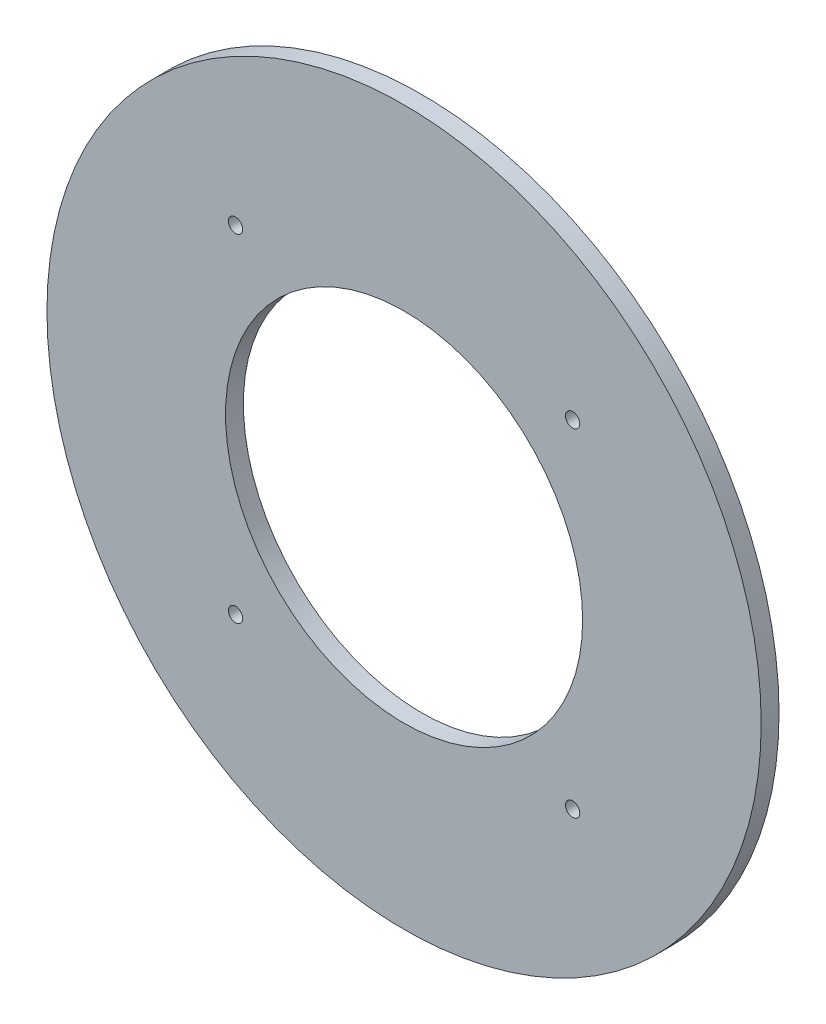
ISO-10303-21;
HEADER;
FILE_DESCRIPTION(('STEP AP214'),'2;1');
FILE_NAME('part.step','',(''),(''),'','','');
FILE_SCHEMA(('AUTOMOTIVE_DESIGN { 1 0 10303 214 1 1 1 1 }'));
ENDSEC;
DATA;
#1=APPLICATION_CONTEXT('core data for automotive mechanical design processes');
#2=APPLICATION_PROTOCOL_DEFINITION('international standard','automotive_design',2000,#1);
#3=PRODUCT_CONTEXT('',#1,'mechanical');
#4=PRODUCT('Part','Part','',(#3));
#5=PRODUCT_RELATED_PRODUCT_CATEGORY('part','',(#4));
#6=PRODUCT_DEFINITION_FORMATION('','',#4);
#7=PRODUCT_DEFINITION_CONTEXT('part definition',#1,'design');
#8=PRODUCT_DEFINITION('design','',#6,#7);
#9=PRODUCT_DEFINITION_SHAPE('','',#8);
#10=(LENGTH_UNIT() NAMED_UNIT(*) SI_UNIT(.MILLI.,.METRE.));
#11=(NAMED_UNIT(*) PLANE_ANGLE_UNIT() SI_UNIT($,.RADIAN.));
#12=(NAMED_UNIT(*) SI_UNIT($,.STERADIAN.) SOLID_ANGLE_UNIT());
#13=UNCERTAINTY_MEASURE_WITH_UNIT(LENGTH_MEASURE(1.E-05),#10,'distance_accuracy_value','');
#14=(GEOMETRIC_REPRESENTATION_CONTEXT(3) GLOBAL_UNCERTAINTY_ASSIGNED_CONTEXT((#13)) GLOBAL_UNIT_ASSIGNED_CONTEXT((#10,
#11,#12)) REPRESENTATION_CONTEXT('',''));
#15=CARTESIAN_POINT('',(0.,0.,0.));
#16=DIRECTION('',(0.,0.,1.));
#17=DIRECTION('',(1.,0.,0.));
#18=AXIS2_PLACEMENT_3D('',#15,#16,#17);
#19=CARTESIAN_POINT('',(0.,0.,6.35));
#20=DIRECTION('',(0.,0.,1.));
#21=DIRECTION('',(1.,0.,0.));
#22=AXIS2_PLACEMENT_3D('',#19,#20,#21);
#23=PLANE('',#22);
#24=CARTESIAN_POINT('',(-59.944,-59.944,6.35));
#25=DIRECTION('',(0.,0.,1.));
#26=DIRECTION('',(1.,0.,0.));
#27=AXIS2_PLACEMENT_3D('',#24,#25,#26);
#28=CIRCLE('',#27,2.54);
#29=CARTESIAN_POINT('',(-57.404,-59.944,6.35));
#30=VERTEX_POINT('',#29);
#31=EDGE_CURVE('E73',#30,#30,#28,.T.);
#32=ORIENTED_EDGE('',*,*,#31,.F.);
#33=EDGE_LOOP('',(#32));
#34=FACE_BOUND('',#33,.T.);
#35=CARTESIAN_POINT('',(-59.944,59.944,6.35));
#36=DIRECTION('',(0.,0.,1.));
#37=DIRECTION('',(1.,0.,0.));
#38=AXIS2_PLACEMENT_3D('',#35,#36,#37);
#39=CIRCLE('',#38,2.54);
#40=CARTESIAN_POINT('',(-57.404,59.944,6.35));
#41=VERTEX_POINT('',#40);
#42=EDGE_CURVE('E61',#41,#41,#39,.T.);
#43=ORIENTED_EDGE('',*,*,#42,.F.);
#44=EDGE_LOOP('',(#43));
#45=FACE_BOUND('',#44,.T.);
#46=CARTESIAN_POINT('',(0.,0.,6.35));
#47=DIRECTION('',(0.,0.,1.));
#48=DIRECTION('',(1.,0.,0.));
#49=AXIS2_PLACEMENT_3D('',#46,#47,#48);
#50=CIRCLE('',#49,127.);
#51=CARTESIAN_POINT('',(127.,0.,6.35));
#52=VERTEX_POINT('',#51);
#53=EDGE_CURVE('E12',#52,#52,#50,.T.);
#54=ORIENTED_EDGE('',*,*,#53,.T.);
#55=EDGE_LOOP('',(#54));
#56=FACE_BOUND('',#55,.T.);
#57=CARTESIAN_POINT('',(0.,0.,6.35));
#58=DIRECTION('',(0.,0.,1.));
#59=DIRECTION('',(1.,0.,0.));
#60=AXIS2_PLACEMENT_3D('',#57,#58,#59);
#61=CIRCLE('',#60,63.5);
#62=CARTESIAN_POINT('',(63.5,0.,6.35));
#63=VERTEX_POINT('',#62);
#64=EDGE_CURVE('E56',#63,#63,#61,.T.);
#65=ORIENTED_EDGE('',*,*,#64,.F.);
#66=EDGE_LOOP('',(#65));
#67=FACE_BOUND('',#66,.T.);
#68=CARTESIAN_POINT('',(59.944,59.944,6.35));
#69=DIRECTION('',(0.,0.,1.));
#70=DIRECTION('',(1.,0.,0.));
#71=AXIS2_PLACEMENT_3D('',#68,#69,#70);
#72=CIRCLE('',#71,2.54);
#73=CARTESIAN_POINT('',(62.484,59.944,6.35));
#74=VERTEX_POINT('',#73);
#75=EDGE_CURVE('E67',#74,#74,#72,.T.);
#76=ORIENTED_EDGE('',*,*,#75,.F.);
#77=EDGE_LOOP('',(#76));
#78=FACE_BOUND('',#77,.T.);
#79=CARTESIAN_POINT('',(59.944,-59.944,6.35));
#80=DIRECTION('',(0.,0.,1.));
#81=DIRECTION('',(1.,0.,0.));
#82=AXIS2_PLACEMENT_3D('',#79,#80,#81);
#83=CIRCLE('',#82,2.54);
#84=CARTESIAN_POINT('',(62.484,-59.944,6.35));
#85=VERTEX_POINT('',#84);
#86=EDGE_CURVE('E79',#85,#85,#83,.T.);
#87=ORIENTED_EDGE('',*,*,#86,.F.);
#88=EDGE_LOOP('',(#87));
#89=FACE_BOUND('',#88,.T.);
#90=ADVANCED_FACE('F45',(#34,#45,#56,#67,#78,#89),#23,.T.);
#91=CARTESIAN_POINT('',(0.,0.,0.));
#92=DIRECTION('',(0.,0.,1.));
#93=DIRECTION('',(1.,0.,0.));
#94=AXIS2_PLACEMENT_3D('',#91,#92,#93);
#95=PLANE('',#94);
#96=CARTESIAN_POINT('',(0.,0.,0.));
#97=DIRECTION('',(0.,0.,1.));
#98=DIRECTION('',(1.,0.,0.));
#99=AXIS2_PLACEMENT_3D('',#96,#97,#98);
#100=CIRCLE('',#99,127.);
#101=CARTESIAN_POINT('',(127.,0.,0.));
#102=VERTEX_POINT('',#101);
#103=EDGE_CURVE('E49',#102,#102,#100,.T.);
#104=ORIENTED_EDGE('',*,*,#103,.F.);
#105=EDGE_LOOP('',(#104));
#106=FACE_BOUND('',#105,.T.);
#107=CARTESIAN_POINT('',(0.,0.,0.));
#108=DIRECTION('',(0.,0.,1.));
#109=DIRECTION('',(1.,0.,0.));
#110=AXIS2_PLACEMENT_3D('',#107,#108,#109);
#111=CIRCLE('',#110,63.5);
#112=CARTESIAN_POINT('',(63.5,0.,0.));
#113=VERTEX_POINT('',#112);
#114=EDGE_CURVE('E58',#113,#113,#111,.T.);
#115=ORIENTED_EDGE('',*,*,#114,.T.);
#116=EDGE_LOOP('',(#115));
#117=FACE_BOUND('',#116,.T.);
#118=CARTESIAN_POINT('',(-59.944,59.944,0.));
#119=DIRECTION('',(0.,0.,1.));
#120=DIRECTION('',(1.,0.,0.));
#121=AXIS2_PLACEMENT_3D('',#118,#119,#120);
#122=CIRCLE('',#121,2.54);
#123=CARTESIAN_POINT('',(-57.404,59.944,0.));
#124=VERTEX_POINT('',#123);
#125=EDGE_CURVE('E64',#124,#124,#122,.T.);
#126=ORIENTED_EDGE('',*,*,#125,.T.);
#127=EDGE_LOOP('',(#126));
#128=FACE_BOUND('',#127,.T.);
#129=CARTESIAN_POINT('',(59.944,59.944,0.));
#130=DIRECTION('',(0.,0.,1.));
#131=DIRECTION('',(1.,0.,0.));
#132=AXIS2_PLACEMENT_3D('',#129,#130,#131);
#133=CIRCLE('',#132,2.54);
#134=CARTESIAN_POINT('',(62.484,59.944,0.));
#135=VERTEX_POINT('',#134);
#136=EDGE_CURVE('E70',#135,#135,#133,.T.);
#137=ORIENTED_EDGE('',*,*,#136,.T.);
#138=EDGE_LOOP('',(#137));
#139=FACE_BOUND('',#138,.T.);
#140=CARTESIAN_POINT('',(-59.944,-59.944,0.));
#141=DIRECTION('',(0.,0.,1.));
#142=DIRECTION('',(1.,0.,0.));
#143=AXIS2_PLACEMENT_3D('',#140,#141,#142);
#144=CIRCLE('',#143,2.54);
#145=CARTESIAN_POINT('',(-57.404,-59.944,0.));
#146=VERTEX_POINT('',#145);
#147=EDGE_CURVE('E76',#146,#146,#144,.T.);
#148=ORIENTED_EDGE('',*,*,#147,.T.);
#149=EDGE_LOOP('',(#148));
#150=FACE_BOUND('',#149,.T.);
#151=CARTESIAN_POINT('',(59.944,-59.944,0.));
#152=DIRECTION('',(0.,0.,1.));
#153=DIRECTION('',(1.,0.,0.));
#154=AXIS2_PLACEMENT_3D('',#151,#152,#153);
#155=CIRCLE('',#154,2.54);
#156=CARTESIAN_POINT('',(62.484,-59.944,0.));
#157=VERTEX_POINT('',#156);
#158=EDGE_CURVE('E82',#157,#157,#155,.T.);
#159=ORIENTED_EDGE('',*,*,#158,.T.);
#160=EDGE_LOOP('',(#159));
#161=FACE_BOUND('',#160,.T.);
#162=ADVANCED_FACE('F92',(#106,#117,#128,#139,#150,#161),#95,.F.);
#163=CARTESIAN_POINT('',(0.,0.,6.35));
#164=DIRECTION('',(0.,0.,-1.));
#165=DIRECTION('',(-1.,0.,0.));
#166=AXIS2_PLACEMENT_3D('',#163,#164,#165);
#167=CYLINDRICAL_SURFACE('',#166,127.);
#168=ORIENTED_EDGE('',*,*,#53,.F.);
#169=EDGE_LOOP('',(#168));
#170=FACE_BOUND('',#169,.T.);
#171=ORIENTED_EDGE('',*,*,#103,.T.);
#172=EDGE_LOOP('',(#171));
#173=FACE_BOUND('',#172,.T.);
#174=ADVANCED_FACE('F47',(#170,#173),#167,.T.);
#175=CARTESIAN_POINT('',(0.,0.,6.35));
#176=DIRECTION('',(0.,0.,-1.));
#177=DIRECTION('',(-1.,0.,0.));
#178=AXIS2_PLACEMENT_3D('',#175,#176,#177);
#179=CYLINDRICAL_SURFACE('',#178,63.5);
#180=ORIENTED_EDGE('',*,*,#64,.T.);
#181=EDGE_LOOP('',(#180));
#182=FACE_BOUND('',#181,.T.);
#183=ORIENTED_EDGE('',*,*,#114,.F.);
#184=EDGE_LOOP('',(#183));
#185=FACE_BOUND('',#184,.T.);
#186=ADVANCED_FACE('F102',(#182,#185),#179,.F.);
#187=CARTESIAN_POINT('',(-59.944,59.944,6.35));
#188=DIRECTION('',(0.,0.,-1.));
#189=DIRECTION('',(-1.,0.,0.));
#190=AXIS2_PLACEMENT_3D('',#187,#188,#189);
#191=CYLINDRICAL_SURFACE('',#190,2.54);
#192=ORIENTED_EDGE('',*,*,#42,.T.);
#193=EDGE_LOOP('',(#192));
#194=FACE_BOUND('',#193,.T.);
#195=ORIENTED_EDGE('',*,*,#125,.F.);
#196=EDGE_LOOP('',(#195));
#197=FACE_BOUND('',#196,.T.);
#198=ADVANCED_FACE('F105',(#194,#197),#191,.F.);
#199=CARTESIAN_POINT('',(59.944,59.944,6.35));
#200=DIRECTION('',(0.,0.,-1.));
#201=DIRECTION('',(-1.,0.,0.));
#202=AXIS2_PLACEMENT_3D('',#199,#200,#201);
#203=CYLINDRICAL_SURFACE('',#202,2.54);
#204=ORIENTED_EDGE('',*,*,#75,.T.);
#205=EDGE_LOOP('',(#204));
#206=FACE_BOUND('',#205,.T.);
#207=ORIENTED_EDGE('',*,*,#136,.F.);
#208=EDGE_LOOP('',(#207));
#209=FACE_BOUND('',#208,.T.);
#210=ADVANCED_FACE('F109',(#206,#209),#203,.F.);
#211=CARTESIAN_POINT('',(-59.944,-59.944,6.35));
#212=DIRECTION('',(0.,0.,-1.));
#213=DIRECTION('',(-1.,0.,0.));
#214=AXIS2_PLACEMENT_3D('',#211,#212,#213);
#215=CYLINDRICAL_SURFACE('',#214,2.54);
#216=ORIENTED_EDGE('',*,*,#31,.T.);
#217=EDGE_LOOP('',(#216));
#218=FACE_BOUND('',#217,.T.);
#219=ORIENTED_EDGE('',*,*,#147,.F.);
#220=EDGE_LOOP('',(#219));
#221=FACE_BOUND('',#220,.T.);
#222=ADVANCED_FACE('F113',(#218,#221),#215,.F.);
#223=CARTESIAN_POINT('',(59.944,-59.944,6.35));
#224=DIRECTION('',(0.,0.,-1.));
#225=DIRECTION('',(-1.,0.,0.));
#226=AXIS2_PLACEMENT_3D('',#223,#224,#225);
#227=CYLINDRICAL_SURFACE('',#226,2.54);
#228=ORIENTED_EDGE('',*,*,#86,.T.);
#229=EDGE_LOOP('',(#228));
#230=FACE_BOUND('',#229,.T.);
#231=ORIENTED_EDGE('',*,*,#158,.F.);
#232=EDGE_LOOP('',(#231));
#233=FACE_BOUND('',#232,.T.);
#234=ADVANCED_FACE('F88',(#230,#233),#227,.F.);
#235=CLOSED_SHELL('',(#90,#162,#174,#186,#198,#210,#222,#234));
#236=MANIFOLD_SOLID_BREP('B2',#235);
#237=ADVANCED_BREP_SHAPE_REPRESENTATION('',(#18,#236),#14);
#238=SHAPE_DEFINITION_REPRESENTATION(#9,#237);
ENDSEC;
END-ISO-10303-21;
